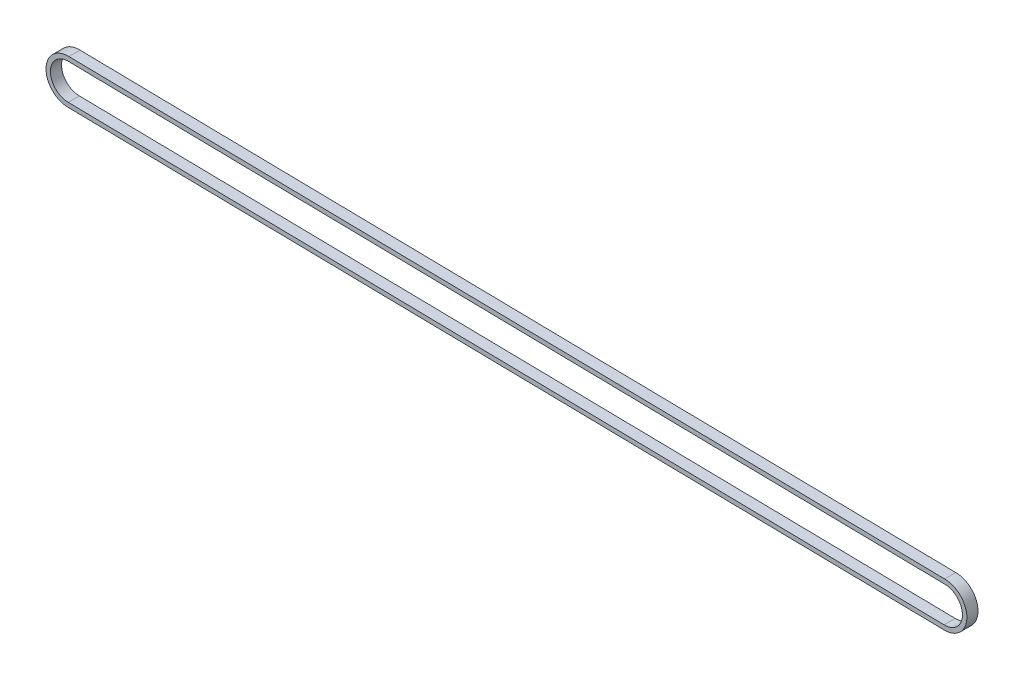
ISO-10303-21;
HEADER;
FILE_DESCRIPTION(('STEP AP214'),'2;1');
FILE_NAME('part.step','',(''),(''),'','','');
FILE_SCHEMA(('AUTOMOTIVE_DESIGN { 1 0 10303 214 1 1 1 1 }'));
ENDSEC;
DATA;
#1=APPLICATION_CONTEXT('core data for automotive mechanical design processes');
#2=APPLICATION_PROTOCOL_DEFINITION('international standard','automotive_design',2000,#1);
#3=PRODUCT_CONTEXT('',#1,'mechanical');
#4=PRODUCT('Part','Part','',(#3));
#5=PRODUCT_RELATED_PRODUCT_CATEGORY('part','',(#4));
#6=PRODUCT_DEFINITION_FORMATION('','',#4);
#7=PRODUCT_DEFINITION_CONTEXT('part definition',#1,'design');
#8=PRODUCT_DEFINITION('design','',#6,#7);
#9=PRODUCT_DEFINITION_SHAPE('','',#8);
#10=(LENGTH_UNIT() NAMED_UNIT(*) SI_UNIT(.MILLI.,.METRE.));
#11=(NAMED_UNIT(*) PLANE_ANGLE_UNIT() SI_UNIT($,.RADIAN.));
#12=(NAMED_UNIT(*) SI_UNIT($,.STERADIAN.) SOLID_ANGLE_UNIT());
#13=UNCERTAINTY_MEASURE_WITH_UNIT(LENGTH_MEASURE(1.E-05),#10,'distance_accuracy_value','');
#14=(GEOMETRIC_REPRESENTATION_CONTEXT(3) GLOBAL_UNCERTAINTY_ASSIGNED_CONTEXT((#13)) GLOBAL_UNIT_ASSIGNED_CONTEXT((#10,
#11,#12)) REPRESENTATION_CONTEXT('',''));
#15=CARTESIAN_POINT('',(0.,0.,0.));
#16=DIRECTION('',(0.,0.,1.));
#17=DIRECTION('',(1.,0.,0.));
#18=AXIS2_PLACEMENT_3D('',#15,#16,#17);
#19=CARTESIAN_POINT('',(361.797434093982,-8.36679366613985,5.));
#20=DIRECTION('',(0.,0.,1.));
#21=DIRECTION('',(1.,0.,0.));
#22=AXIS2_PLACEMENT_3D('',#19,#20,#21);
#23=PLANE('',#22);
#24=CARTESIAN_POINT('',(361.797434093982,-8.36679366613985,5.));
#25=DIRECTION('',(0.,0.,1.));
#26=DIRECTION('',(1.,0.,0.));
#27=AXIS2_PLACEMENT_3D('',#24,#25,#26);
#28=CIRCLE('',#27,9.99999999999758);
#29=CARTESIAN_POINT('',(361.464381374368,-18.3612459215584,5.));
#30=VERTEX_POINT('',#29);
#31=CARTESIAN_POINT('',(361.797434093982,1.63320633386113,5.));
#32=VERTEX_POINT('',#31);
#33=EDGE_CURVE('E133',#30,#32,#28,.T.);
#34=ORIENTED_EDGE('',*,*,#33,.T.);
#35=DIRECTION('',(-0.999861296766075,0.0166549460900697,0.));
#36=VECTOR('',#35,1.);
#37=CARTESIAN_POINT('',(-32.2948679221798,8.19770289535394,5.));
#38=LINE('',#37,#36);
#39=CARTESIAN_POINT('',(-32.2948679221798,8.19770289535394,5.));
#40=VERTEX_POINT('',#39);
#41=EDGE_CURVE('E136',#32,#40,#38,.T.);
#42=ORIENTED_EDGE('',*,*,#41,.T.);
#43=CARTESIAN_POINT('',(-32.6279206420836,-1.7967493600608,5.));
#44=DIRECTION('',(0.,0.,1.));
#45=DIRECTION('',(1.,0.,0.));
#46=AXIS2_PLACEMENT_3D('',#43,#44,#45);
#47=CIRCLE('',#46,10.);
#48=CARTESIAN_POINT('',(-32.6279206420837,-11.7967493600608,5.));
#49=VERTEX_POINT('',#48);
#50=EDGE_CURVE('E139',#40,#49,#47,.T.);
#51=ORIENTED_EDGE('',*,*,#50,.T.);
#52=DIRECTION('',(0.999861296766075,-0.0166549460900697,0.));
#53=VECTOR('',#52,1.);
#54=CARTESIAN_POINT('',(-32.6279206420837,-11.7967493600608,5.));
#55=LINE('',#54,#53);
#56=EDGE_CURVE('E141',#49,#30,#55,.T.);
#57=ORIENTED_EDGE('',*,*,#56,.T.);
#58=EDGE_LOOP('',(#34,#42,#51,#57));
#59=FACE_BOUND('',#58,.T.);
#60=DIRECTION('',(0.999861296766075,-0.0166549460900678,0.));
#61=VECTOR('',#60,1.);
#62=CARTESIAN_POINT('',(-32.6279206420836,-9.7967493600608,5.));
#63=LINE('',#62,#61);
#64=CARTESIAN_POINT('',(-32.6279206420836,-9.7967493600608,5.));
#65=VERTEX_POINT('',#64);
#66=CARTESIAN_POINT('',(361.530991918264,-16.3623554704771,5.));
#67=VERTEX_POINT('',#66);
#68=EDGE_CURVE('E105',#65,#67,#63,.T.);
#69=ORIENTED_EDGE('',*,*,#68,.F.);
#70=CARTESIAN_POINT('',(-32.6279206420836,-1.7967493600608,5.));
#71=DIRECTION('',(0.,0.,1.));
#72=DIRECTION('',(1.,0.,0.));
#73=AXIS2_PLACEMENT_3D('',#70,#71,#72);
#74=CIRCLE('',#73,8.);
#75=CARTESIAN_POINT('',(-32.3614784661551,6.19881244427081,5.));
#76=VERTEX_POINT('',#75);
#77=EDGE_CURVE('E97',#76,#65,#74,.T.);
#78=ORIENTED_EDGE('',*,*,#77,.F.);
#79=DIRECTION('',(-0.999861296766075,0.016654946090066,0.));
#80=VECTOR('',#79,1.);
#81=CARTESIAN_POINT('',(361.797434093982,-0.366793666137491,5.));
#82=LINE('',#81,#80);
#83=CARTESIAN_POINT('',(361.797434093982,-0.36679366613749,5.));
#84=VERTEX_POINT('',#83);
#85=EDGE_CURVE('E119',#84,#76,#82,.T.);
#86=ORIENTED_EDGE('',*,*,#85,.F.);
#87=CARTESIAN_POINT('',(361.797434093982,-8.36679366613985,5.));
#88=DIRECTION('',(0.,0.,1.));
#89=DIRECTION('',(1.,0.,0.));
#90=AXIS2_PLACEMENT_3D('',#87,#88,#89);
#91=CIRCLE('',#90,7.99999999999862);
#92=EDGE_CURVE('E117',#67,#84,#91,.T.);
#93=ORIENTED_EDGE('',*,*,#92,.F.);
#94=EDGE_LOOP('',(#69,#78,#86,#93));
#95=FACE_BOUND('',#94,.T.);
#96=ADVANCED_FACE('F32',(#59,#95),#23,.T.);
#97=CARTESIAN_POINT('',(361.797434093982,-8.36679366613985,0.));
#98=DIRECTION('',(0.,0.,1.));
#99=DIRECTION('',(1.,0.,0.));
#100=AXIS2_PLACEMENT_3D('',#97,#98,#99);
#101=PLANE('',#100);
#102=CARTESIAN_POINT('',(361.797434093982,-8.36679366613985,0.));
#103=DIRECTION('',(0.,0.,1.));
#104=DIRECTION('',(1.,0.,0.));
#105=AXIS2_PLACEMENT_3D('',#102,#103,#104);
#106=CIRCLE('',#105,9.99999999999758);
#107=CARTESIAN_POINT('',(361.464381374368,-18.3612459215584,0.));
#108=VERTEX_POINT('',#107);
#109=CARTESIAN_POINT('',(361.797434093982,1.63320633386113,0.));
#110=VERTEX_POINT('',#109);
#111=EDGE_CURVE('E113',#108,#110,#106,.T.);
#112=ORIENTED_EDGE('',*,*,#111,.F.);
#113=DIRECTION('',(0.999861296766075,-0.0166549460900697,0.));
#114=VECTOR('',#113,1.);
#115=CARTESIAN_POINT('',(-32.6279206420837,-11.7967493600608,0.));
#116=LINE('',#115,#114);
#117=CARTESIAN_POINT('',(-32.6279206420837,-11.7967493600608,0.));
#118=VERTEX_POINT('',#117);
#119=EDGE_CURVE('E137',#118,#108,#116,.T.);
#120=ORIENTED_EDGE('',*,*,#119,.F.);
#121=CARTESIAN_POINT('',(-32.6279206420836,-1.7967493600608,0.));
#122=DIRECTION('',(0.,0.,1.));
#123=DIRECTION('',(1.,0.,0.));
#124=AXIS2_PLACEMENT_3D('',#121,#122,#123);
#125=CIRCLE('',#124,10.);
#126=CARTESIAN_POINT('',(-32.2948679221798,8.19770289535394,0.));
#127=VERTEX_POINT('',#126);
#128=EDGE_CURVE('E148',#127,#118,#125,.T.);
#129=ORIENTED_EDGE('',*,*,#128,.F.);
#130=DIRECTION('',(-0.999861296766075,0.0166549460900697,0.));
#131=VECTOR('',#130,1.);
#132=CARTESIAN_POINT('',(-32.2948679221798,8.19770289535394,0.));
#133=LINE('',#132,#131);
#134=EDGE_CURVE('E146',#110,#127,#133,.T.);
#135=ORIENTED_EDGE('',*,*,#134,.F.);
#136=EDGE_LOOP('',(#112,#120,#129,#135));
#137=FACE_BOUND('',#136,.T.);
#138=CARTESIAN_POINT('',(-32.6279206420836,-1.7967493600608,0.));
#139=DIRECTION('',(0.,0.,1.));
#140=DIRECTION('',(1.,0.,0.));
#141=AXIS2_PLACEMENT_3D('',#138,#139,#140);
#142=CIRCLE('',#141,8.);
#143=CARTESIAN_POINT('',(-32.3614784661551,6.19881244427081,0.));
#144=VERTEX_POINT('',#143);
#145=CARTESIAN_POINT('',(-32.6279206420836,-9.7967493600608,0.));
#146=VERTEX_POINT('',#145);
#147=EDGE_CURVE('E55',#144,#146,#142,.T.);
#148=ORIENTED_EDGE('',*,*,#147,.T.);
#149=DIRECTION('',(0.999861296766075,-0.0166549460900678,0.));
#150=VECTOR('',#149,1.);
#151=CARTESIAN_POINT('',(-32.6279206420836,-9.7967493600608,0.));
#152=LINE('',#151,#150);
#153=CARTESIAN_POINT('',(361.530991918264,-16.3623554704771,0.));
#154=VERTEX_POINT('',#153);
#155=EDGE_CURVE('E112',#146,#154,#152,.T.);
#156=ORIENTED_EDGE('',*,*,#155,.T.);
#157=CARTESIAN_POINT('',(361.797434093982,-8.36679366613985,0.));
#158=DIRECTION('',(0.,0.,1.));
#159=DIRECTION('',(1.,0.,0.));
#160=AXIS2_PLACEMENT_3D('',#157,#158,#159);
#161=CIRCLE('',#160,7.99999999999862);
#162=CARTESIAN_POINT('',(361.797434093982,-0.366793666137491,0.));
#163=VERTEX_POINT('',#162);
#164=EDGE_CURVE('E125',#154,#163,#161,.T.);
#165=ORIENTED_EDGE('',*,*,#164,.T.);
#166=DIRECTION('',(-0.999861296766075,0.016654946090066,0.));
#167=VECTOR('',#166,1.);
#168=CARTESIAN_POINT('',(361.797434093982,-0.366793666137491,0.));
#169=LINE('',#168,#167);
#170=EDGE_CURVE('E106',#163,#144,#169,.T.);
#171=ORIENTED_EDGE('',*,*,#170,.T.);
#172=EDGE_LOOP('',(#148,#156,#165,#171));
#173=FACE_BOUND('',#172,.T.);
#174=ADVANCED_FACE('F166',(#137,#173),#101,.F.);
#175=CARTESIAN_POINT('',(361.797434093982,-8.36679366613985,5.));
#176=DIRECTION('',(0.,0.,-1.));
#177=DIRECTION('',(-1.,0.,0.));
#178=AXIS2_PLACEMENT_3D('',#175,#176,#177);
#179=CYLINDRICAL_SURFACE('',#178,9.99999999999758);
#180=ORIENTED_EDGE('',*,*,#111,.T.);
#181=DIRECTION('',(0.,0.,-1.));
#182=VECTOR('',#181,1.);
#183=CARTESIAN_POINT('',(361.797434093982,1.63320633386113,5.));
#184=LINE('',#183,#182);
#185=EDGE_CURVE('E11',#32,#110,#184,.T.);
#186=ORIENTED_EDGE('',*,*,#185,.F.);
#187=ORIENTED_EDGE('',*,*,#33,.F.);
#188=DIRECTION('',(0.,0.,-1.));
#189=VECTOR('',#188,1.);
#190=CARTESIAN_POINT('',(361.464381374368,-18.3612459215584,5.));
#191=LINE('',#190,#189);
#192=EDGE_CURVE('E143',#30,#108,#191,.T.);
#193=ORIENTED_EDGE('',*,*,#192,.T.);
#194=EDGE_LOOP('',(#180,#186,#187,#193));
#195=FACE_BOUND('',#194,.T.);
#196=ADVANCED_FACE('F34',(#195),#179,.T.);
#197=CARTESIAN_POINT('',(-32.2948679221798,8.19770289535394,5.));
#198=DIRECTION('',(-0.0166549460900697,-0.999861296766075,0.));
#199=DIRECTION('',(0.999861296766075,-0.0166549460900697,0.));
#200=AXIS2_PLACEMENT_3D('',#197,#198,#199);
#201=PLANE('',#200);
#202=ORIENTED_EDGE('',*,*,#134,.T.);
#203=DIRECTION('',(0.,0.,-1.));
#204=VECTOR('',#203,1.);
#205=CARTESIAN_POINT('',(-32.2948679221798,8.19770289535394,5.));
#206=LINE('',#205,#204);
#207=EDGE_CURVE('E40',#40,#127,#206,.T.);
#208=ORIENTED_EDGE('',*,*,#207,.F.);
#209=ORIENTED_EDGE('',*,*,#41,.F.);
#210=ORIENTED_EDGE('',*,*,#185,.T.);
#211=EDGE_LOOP('',(#202,#208,#209,#210));
#212=FACE_BOUND('',#211,.T.);
#213=ADVANCED_FACE('F176',(#212),#201,.F.);
#214=CARTESIAN_POINT('',(-32.6279206420836,-1.7967493600608,5.));
#215=DIRECTION('',(0.,0.,-1.));
#216=DIRECTION('',(-1.,0.,0.));
#217=AXIS2_PLACEMENT_3D('',#214,#215,#216);
#218=CYLINDRICAL_SURFACE('',#217,10.);
#219=ORIENTED_EDGE('',*,*,#128,.T.);
#220=DIRECTION('',(0.,0.,-1.));
#221=VECTOR('',#220,1.);
#222=CARTESIAN_POINT('',(-32.6279206420837,-11.7967493600608,5.));
#223=LINE('',#222,#221);
#224=EDGE_CURVE('E153',#49,#118,#223,.T.);
#225=ORIENTED_EDGE('',*,*,#224,.F.);
#226=ORIENTED_EDGE('',*,*,#50,.F.);
#227=ORIENTED_EDGE('',*,*,#207,.T.);
#228=EDGE_LOOP('',(#219,#225,#226,#227));
#229=FACE_BOUND('',#228,.T.);
#230=ADVANCED_FACE('F160',(#229),#218,.T.);
#231=CARTESIAN_POINT('',(-32.6279206420837,-11.7967493600608,5.));
#232=DIRECTION('',(0.0166549460900697,0.999861296766075,0.));
#233=DIRECTION('',(-0.999861296766075,0.0166549460900697,0.));
#234=AXIS2_PLACEMENT_3D('',#231,#232,#233);
#235=PLANE('',#234);
#236=ORIENTED_EDGE('',*,*,#119,.T.);
#237=ORIENTED_EDGE('',*,*,#192,.F.);
#238=ORIENTED_EDGE('',*,*,#56,.F.);
#239=ORIENTED_EDGE('',*,*,#224,.T.);
#240=EDGE_LOOP('',(#236,#237,#238,#239));
#241=FACE_BOUND('',#240,.T.);
#242=ADVANCED_FACE('F170',(#241),#235,.F.);
#243=CARTESIAN_POINT('',(-32.6279206420836,-1.7967493600608,5.));
#244=DIRECTION('',(0.,0.,-1.));
#245=DIRECTION('',(-1.,0.,0.));
#246=AXIS2_PLACEMENT_3D('',#243,#244,#245);
#247=CYLINDRICAL_SURFACE('',#246,8.);
#248=ORIENTED_EDGE('',*,*,#147,.F.);
#249=DIRECTION('',(0.,0.,-1.));
#250=VECTOR('',#249,1.);
#251=CARTESIAN_POINT('',(-32.3614784661551,6.19881244427081,5.));
#252=LINE('',#251,#250);
#253=EDGE_CURVE('E101',#76,#144,#252,.T.);
#254=ORIENTED_EDGE('',*,*,#253,.F.);
#255=ORIENTED_EDGE('',*,*,#77,.T.);
#256=DIRECTION('',(0.,0.,-1.));
#257=VECTOR('',#256,1.);
#258=CARTESIAN_POINT('',(-32.6279206420836,-9.7967493600608,5.));
#259=LINE('',#258,#257);
#260=EDGE_CURVE('E100',#65,#146,#259,.T.);
#261=ORIENTED_EDGE('',*,*,#260,.T.);
#262=EDGE_LOOP('',(#248,#254,#255,#261));
#263=FACE_BOUND('',#262,.T.);
#264=ADVANCED_FACE('F99',(#263),#247,.F.);
#265=CARTESIAN_POINT('',(-32.6279206420836,-9.7967493600608,5.));
#266=DIRECTION('',(0.0166549460900678,0.999861296766075,0.));
#267=DIRECTION('',(-0.999861296766075,0.0166549460900678,0.));
#268=AXIS2_PLACEMENT_3D('',#265,#266,#267);
#269=PLANE('',#268);
#270=ORIENTED_EDGE('',*,*,#155,.F.);
#271=ORIENTED_EDGE('',*,*,#260,.F.);
#272=ORIENTED_EDGE('',*,*,#68,.T.);
#273=DIRECTION('',(0.,0.,-1.));
#274=VECTOR('',#273,1.);
#275=CARTESIAN_POINT('',(361.530991918264,-16.3623554704771,5.));
#276=LINE('',#275,#274);
#277=EDGE_CURVE('E114',#67,#154,#276,.T.);
#278=ORIENTED_EDGE('',*,*,#277,.T.);
#279=EDGE_LOOP('',(#270,#271,#272,#278));
#280=FACE_BOUND('',#279,.T.);
#281=ADVANCED_FACE('F109',(#280),#269,.T.);
#282=CARTESIAN_POINT('',(361.797434093982,-8.36679366613985,5.));
#283=DIRECTION('',(0.,0.,-1.));
#284=DIRECTION('',(-1.,0.,0.));
#285=AXIS2_PLACEMENT_3D('',#282,#283,#284);
#286=CYLINDRICAL_SURFACE('',#285,7.99999999999862);
#287=ORIENTED_EDGE('',*,*,#164,.F.);
#288=ORIENTED_EDGE('',*,*,#277,.F.);
#289=ORIENTED_EDGE('',*,*,#92,.T.);
#290=DIRECTION('',(0.,0.,-1.));
#291=VECTOR('',#290,1.);
#292=CARTESIAN_POINT('',(361.797434093982,-0.366793666137491,5.));
#293=LINE('',#292,#291);
#294=EDGE_CURVE('E47',#84,#163,#293,.T.);
#295=ORIENTED_EDGE('',*,*,#294,.T.);
#296=EDGE_LOOP('',(#287,#288,#289,#295));
#297=FACE_BOUND('',#296,.T.);
#298=ADVANCED_FACE('F199',(#297),#286,.F.);
#299=CARTESIAN_POINT('',(361.797434093982,-0.366793666137491,5.));
#300=DIRECTION('',(-0.016654946090066,-0.999861296766075,0.));
#301=DIRECTION('',(0.999861296766075,-0.016654946090066,0.));
#302=AXIS2_PLACEMENT_3D('',#299,#300,#301);
#303=PLANE('',#302);
#304=ORIENTED_EDGE('',*,*,#170,.F.);
#305=ORIENTED_EDGE('',*,*,#294,.F.);
#306=ORIENTED_EDGE('',*,*,#85,.T.);
#307=ORIENTED_EDGE('',*,*,#253,.T.);
#308=EDGE_LOOP('',(#304,#305,#306,#307));
#309=FACE_BOUND('',#308,.T.);
#310=ADVANCED_FACE('F203',(#309),#303,.T.);
#311=CLOSED_SHELL('',(#96,#174,#196,#213,#230,#242,#264,#281,#298,#310));
#312=MANIFOLD_SOLID_BREP('B2',#311);
#313=ADVANCED_BREP_SHAPE_REPRESENTATION('',(#18,#312),#14);
#314=SHAPE_DEFINITION_REPRESENTATION(#9,#313);
ENDSEC;
END-ISO-10303-21;
